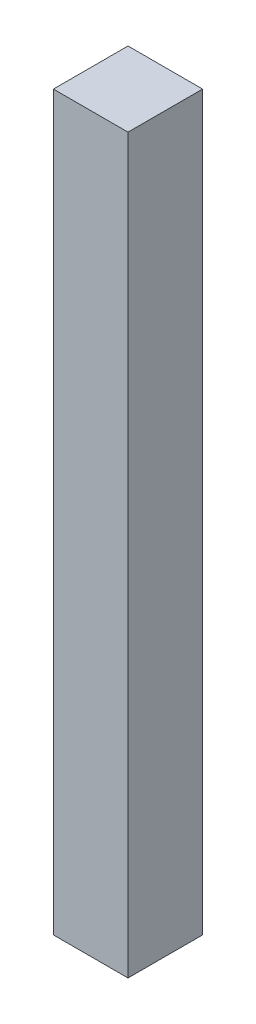
ISO-10303-21;
HEADER;
FILE_DESCRIPTION(('STEP AP214'),'2;1');
FILE_NAME('part.step','',(''),(''),'','','');
FILE_SCHEMA(('AUTOMOTIVE_DESIGN { 1 0 10303 214 1 1 1 1 }'));
ENDSEC;
DATA;
#1=APPLICATION_CONTEXT('core data for automotive mechanical design processes');
#2=APPLICATION_PROTOCOL_DEFINITION('international standard','automotive_design',2000,#1);
#3=PRODUCT_CONTEXT('',#1,'mechanical');
#4=PRODUCT('Part','Part','',(#3));
#5=PRODUCT_RELATED_PRODUCT_CATEGORY('part','',(#4));
#6=PRODUCT_DEFINITION_FORMATION('','',#4);
#7=PRODUCT_DEFINITION_CONTEXT('part definition',#1,'design');
#8=PRODUCT_DEFINITION('design','',#6,#7);
#9=PRODUCT_DEFINITION_SHAPE('','',#8);
#10=(LENGTH_UNIT() NAMED_UNIT(*) SI_UNIT(.MILLI.,.METRE.));
#11=(NAMED_UNIT(*) PLANE_ANGLE_UNIT() SI_UNIT($,.RADIAN.));
#12=(NAMED_UNIT(*) SI_UNIT($,.STERADIAN.) SOLID_ANGLE_UNIT());
#13=UNCERTAINTY_MEASURE_WITH_UNIT(LENGTH_MEASURE(1.E-05),#10,'distance_accuracy_value','');
#14=(GEOMETRIC_REPRESENTATION_CONTEXT(3) GLOBAL_UNCERTAINTY_ASSIGNED_CONTEXT((#13)) GLOBAL_UNIT_ASSIGNED_CONTEXT((#10,
#11,#12)) REPRESENTATION_CONTEXT('',''));
#15=CARTESIAN_POINT('',(0.,0.,0.));
#16=DIRECTION('',(0.,0.,1.));
#17=DIRECTION('',(1.,0.,0.));
#18=AXIS2_PLACEMENT_3D('',#15,#16,#17);
#19=CARTESIAN_POINT('',(7.8,6.43,6.29));
#20=DIRECTION('',(1.,0.,0.));
#21=DIRECTION('',(0.,0.,-1.));
#22=AXIS2_PLACEMENT_3D('',#19,#20,#21);
#23=PLANE('',#22);
#24=DIRECTION('',(0.,1.,0.));
#25=VECTOR('',#24,1.);
#26=CARTESIAN_POINT('',(7.8,3.975,5.79));
#27=LINE('',#26,#25);
#28=CARTESIAN_POINT('',(7.8,6.43,5.79));
#29=VERTEX_POINT('',#28);
#30=CARTESIAN_POINT('',(7.8,1.52,5.79));
#31=VERTEX_POINT('',#30);
#32=EDGE_CURVE('E55',#29,#31,#27,.F.);
#33=ORIENTED_EDGE('',*,*,#32,.F.);
#34=DIRECTION('',(0.,0.,1.));
#35=VECTOR('',#34,1.);
#36=CARTESIAN_POINT('',(7.8,6.43,6.29));
#37=LINE('',#36,#35);
#38=CARTESIAN_POINT('',(7.8,6.43,6.29));
#39=VERTEX_POINT('',#38);
#40=EDGE_CURVE('E67',#39,#29,#37,.F.);
#41=ORIENTED_EDGE('',*,*,#40,.F.);
#42=DIRECTION('',(0.,1.,0.));
#43=VECTOR('',#42,1.);
#44=CARTESIAN_POINT('',(7.8,3.975,6.29));
#45=LINE('',#44,#43);
#46=CARTESIAN_POINT('',(7.8,1.52,6.29));
#47=VERTEX_POINT('',#46);
#48=EDGE_CURVE('E20',#39,#47,#45,.F.);
#49=ORIENTED_EDGE('',*,*,#48,.T.);
#50=DIRECTION('',(0.,0.,-1.));
#51=VECTOR('',#50,1.);
#52=CARTESIAN_POINT('',(7.8,1.52,6.29));
#53=LINE('',#52,#51);
#54=EDGE_CURVE('E81',#31,#47,#53,.F.);
#55=ORIENTED_EDGE('',*,*,#54,.F.);
#56=EDGE_LOOP('',(#33,#41,#49,#55));
#57=FACE_BOUND('',#56,.T.);
#58=ADVANCED_FACE('F17',(#57),#23,.T.);
#59=CARTESIAN_POINT('',(7.55,3.975,6.29));
#60=DIRECTION('',(0.,0.,-1.));
#61=DIRECTION('',(-1.,0.,0.));
#62=AXIS2_PLACEMENT_3D('',#59,#60,#61);
#63=PLANE('',#62);
#64=DIRECTION('',(1.,0.,0.));
#65=VECTOR('',#64,1.);
#66=CARTESIAN_POINT('',(7.3,6.43,6.29));
#67=LINE('',#66,#65);
#68=CARTESIAN_POINT('',(7.3,6.43,6.29));
#69=VERTEX_POINT('',#68);
#70=EDGE_CURVE('E62',#69,#39,#67,.T.);
#71=ORIENTED_EDGE('',*,*,#70,.F.);
#72=DIRECTION('',(0.,1.,0.));
#73=VECTOR('',#72,1.);
#74=CARTESIAN_POINT('',(7.3,1.52,6.29));
#75=LINE('',#74,#73);
#76=CARTESIAN_POINT('',(7.3,1.52,6.29));
#77=VERTEX_POINT('',#76);
#78=EDGE_CURVE('E83',#77,#69,#75,.T.);
#79=ORIENTED_EDGE('',*,*,#78,.F.);
#80=DIRECTION('',(1.,0.,0.));
#81=VECTOR('',#80,1.);
#82=CARTESIAN_POINT('',(7.8,1.52,6.29));
#83=LINE('',#82,#81);
#84=EDGE_CURVE('E65',#47,#77,#83,.F.);
#85=ORIENTED_EDGE('',*,*,#84,.F.);
#86=ORIENTED_EDGE('',*,*,#48,.F.);
#87=EDGE_LOOP('',(#71,#79,#85,#86));
#88=FACE_BOUND('',#87,.T.);
#89=ADVANCED_FACE('F60',(#88),#63,.F.);
#90=CARTESIAN_POINT('',(7.3,6.43,6.29));
#91=DIRECTION('',(0.,1.,0.));
#92=DIRECTION('',(0.,0.,1.));
#93=AXIS2_PLACEMENT_3D('',#90,#91,#92);
#94=PLANE('',#93);
#95=DIRECTION('',(-1.,0.,0.));
#96=VECTOR('',#95,1.);
#97=CARTESIAN_POINT('',(7.55,6.43,5.79));
#98=LINE('',#97,#96);
#99=CARTESIAN_POINT('',(7.3,6.43,5.79));
#100=VERTEX_POINT('',#99);
#101=EDGE_CURVE('E77',#100,#29,#98,.F.);
#102=ORIENTED_EDGE('',*,*,#101,.F.);
#103=DIRECTION('',(0.,0.,1.));
#104=VECTOR('',#103,1.);
#105=CARTESIAN_POINT('',(7.3,6.43,6.29));
#106=LINE('',#105,#104);
#107=EDGE_CURVE('E73',#69,#100,#106,.F.);
#108=ORIENTED_EDGE('',*,*,#107,.F.);
#109=ORIENTED_EDGE('',*,*,#70,.T.);
#110=ORIENTED_EDGE('',*,*,#40,.T.);
#111=EDGE_LOOP('',(#102,#108,#109,#110));
#112=FACE_BOUND('',#111,.T.);
#113=ADVANCED_FACE('F71',(#112),#94,.T.);
#114=CARTESIAN_POINT('',(7.55,3.975,5.79));
#115=DIRECTION('',(0.,0.,-1.));
#116=DIRECTION('',(-1.,0.,0.));
#117=AXIS2_PLACEMENT_3D('',#114,#115,#116);
#118=PLANE('',#117);
#119=DIRECTION('',(0.,1.,0.));
#120=VECTOR('',#119,1.);
#121=CARTESIAN_POINT('',(7.3,1.52,5.79));
#122=LINE('',#121,#120);
#123=CARTESIAN_POINT('',(7.3,1.52,5.79));
#124=VERTEX_POINT('',#123);
#125=EDGE_CURVE('E26',#100,#124,#122,.F.);
#126=ORIENTED_EDGE('',*,*,#125,.F.);
#127=ORIENTED_EDGE('',*,*,#101,.T.);
#128=ORIENTED_EDGE('',*,*,#32,.T.);
#129=DIRECTION('',(1.,0.,0.));
#130=VECTOR('',#129,1.);
#131=CARTESIAN_POINT('',(7.8,1.52,5.79));
#132=LINE('',#131,#130);
#133=EDGE_CURVE('E35',#124,#31,#132,.T.);
#134=ORIENTED_EDGE('',*,*,#133,.F.);
#135=EDGE_LOOP('',(#126,#127,#128,#134));
#136=FACE_BOUND('',#135,.T.);
#137=ADVANCED_FACE('F89',(#136),#118,.T.);
#138=CARTESIAN_POINT('',(7.8,1.52,6.29));
#139=DIRECTION('',(0.,-1.,0.));
#140=DIRECTION('',(0.,0.,-1.));
#141=AXIS2_PLACEMENT_3D('',#138,#139,#140);
#142=PLANE('',#141);
#143=ORIENTED_EDGE('',*,*,#133,.T.);
#144=ORIENTED_EDGE('',*,*,#54,.T.);
#145=ORIENTED_EDGE('',*,*,#84,.T.);
#146=DIRECTION('',(0.,0.,1.));
#147=VECTOR('',#146,1.);
#148=CARTESIAN_POINT('',(7.3,1.52,6.29));
#149=LINE('',#148,#147);
#150=EDGE_CURVE('E11',#124,#77,#149,.T.);
#151=ORIENTED_EDGE('',*,*,#150,.F.);
#152=EDGE_LOOP('',(#143,#144,#145,#151));
#153=FACE_BOUND('',#152,.T.);
#154=ADVANCED_FACE('F91',(#153),#142,.T.);
#155=CARTESIAN_POINT('',(7.3,1.52,6.29));
#156=DIRECTION('',(-1.,0.,0.));
#157=DIRECTION('',(0.,0.,1.));
#158=AXIS2_PLACEMENT_3D('',#155,#156,#157);
#159=PLANE('',#158);
#160=ORIENTED_EDGE('',*,*,#125,.T.);
#161=ORIENTED_EDGE('',*,*,#150,.T.);
#162=ORIENTED_EDGE('',*,*,#78,.T.);
#163=ORIENTED_EDGE('',*,*,#107,.T.);
#164=EDGE_LOOP('',(#160,#161,#162,#163));
#165=FACE_BOUND('',#164,.T.);
#166=ADVANCED_FACE('F88',(#165),#159,.T.);
#167=CLOSED_SHELL('',(#58,#89,#113,#137,#154,#166));
#168=MANIFOLD_SOLID_BREP('B1',#167);
#169=ADVANCED_BREP_SHAPE_REPRESENTATION('',(#18,#168),#14);
#170=SHAPE_DEFINITION_REPRESENTATION(#9,#169);
ENDSEC;
END-ISO-10303-21;
